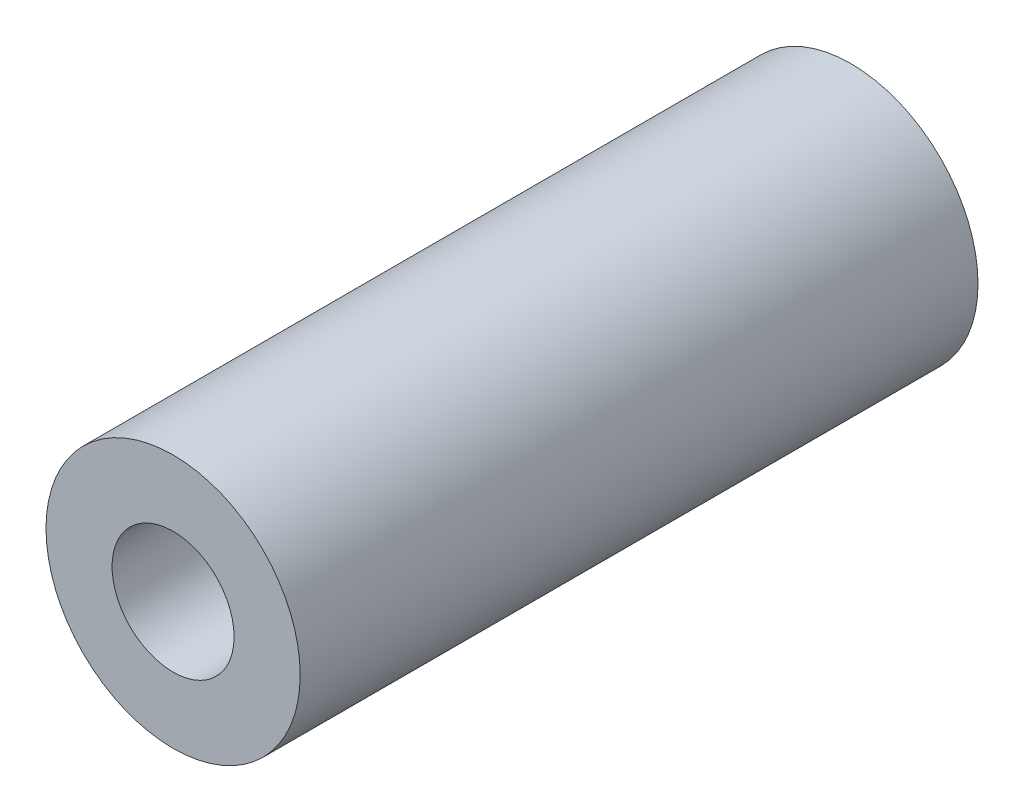
ISO-10303-21;
HEADER;
FILE_DESCRIPTION(('STEP AP214'),'2;1');
FILE_NAME('part.step','',(''),(''),'','','');
FILE_SCHEMA(('AUTOMOTIVE_DESIGN { 1 0 10303 214 1 1 1 1 }'));
ENDSEC;
DATA;
#1=APPLICATION_CONTEXT('core data for automotive mechanical design processes');
#2=APPLICATION_PROTOCOL_DEFINITION('international standard','automotive_design',2000,#1);
#3=PRODUCT_CONTEXT('',#1,'mechanical');
#4=PRODUCT('Part','Part','',(#3));
#5=PRODUCT_RELATED_PRODUCT_CATEGORY('part','',(#4));
#6=PRODUCT_DEFINITION_FORMATION('','',#4);
#7=PRODUCT_DEFINITION_CONTEXT('part definition',#1,'design');
#8=PRODUCT_DEFINITION('design','',#6,#7);
#9=PRODUCT_DEFINITION_SHAPE('','',#8);
#10=(LENGTH_UNIT() NAMED_UNIT(*) SI_UNIT(.MILLI.,.METRE.));
#11=(NAMED_UNIT(*) PLANE_ANGLE_UNIT() SI_UNIT($,.RADIAN.));
#12=(NAMED_UNIT(*) SI_UNIT($,.STERADIAN.) SOLID_ANGLE_UNIT());
#13=UNCERTAINTY_MEASURE_WITH_UNIT(LENGTH_MEASURE(1.E-05),#10,'distance_accuracy_value','');
#14=(GEOMETRIC_REPRESENTATION_CONTEXT(3) GLOBAL_UNCERTAINTY_ASSIGNED_CONTEXT((#13)) GLOBAL_UNIT_ASSIGNED_CONTEXT((#10,
#11,#12)) REPRESENTATION_CONTEXT('',''));
#15=CARTESIAN_POINT('',(0.,0.,0.));
#16=DIRECTION('',(0.,0.,1.));
#17=DIRECTION('',(1.,0.,0.));
#18=AXIS2_PLACEMENT_3D('',#15,#16,#17);
#19=CARTESIAN_POINT('',(0.,0.,6.35));
#20=DIRECTION('',(0.,0.,1.));
#21=DIRECTION('',(1.,0.,0.));
#22=AXIS2_PLACEMENT_3D('',#19,#20,#21);
#23=PLANE('',#22);
#24=CARTESIAN_POINT('',(0.,0.,6.35));
#25=DIRECTION('',(0.,0.,1.));
#26=DIRECTION('',(1.,0.,0.));
#27=AXIS2_PLACEMENT_3D('',#24,#25,#26);
#28=CIRCLE('',#27,2.38125);
#29=CARTESIAN_POINT('',(2.38125,0.,6.35));
#30=VERTEX_POINT('',#29);
#31=EDGE_CURVE('E10',#30,#30,#28,.T.);
#32=ORIENTED_EDGE('',*,*,#31,.T.);
#33=EDGE_LOOP('',(#32));
#34=FACE_BOUND('',#33,.T.);
#35=CARTESIAN_POINT('',(0.,0.,6.35));
#36=DIRECTION('',(0.,0.,1.));
#37=DIRECTION('',(1.,0.,0.));
#38=AXIS2_PLACEMENT_3D('',#35,#36,#37);
#39=CIRCLE('',#38,1.143);
#40=CARTESIAN_POINT('',(1.143,0.,6.35));
#41=VERTEX_POINT('',#40);
#42=EDGE_CURVE('E41',#41,#41,#39,.T.);
#43=ORIENTED_EDGE('',*,*,#42,.F.);
#44=EDGE_LOOP('',(#43));
#45=FACE_BOUND('',#44,.T.);
#46=ADVANCED_FACE('F30',(#34,#45),#23,.T.);
#47=CARTESIAN_POINT('',(0.,0.,-6.35));
#48=DIRECTION('',(0.,0.,1.));
#49=DIRECTION('',(1.,0.,0.));
#50=AXIS2_PLACEMENT_3D('',#47,#48,#49);
#51=PLANE('',#50);
#52=CARTESIAN_POINT('',(0.,0.,-6.35));
#53=DIRECTION('',(0.,0.,1.));
#54=DIRECTION('',(1.,0.,0.));
#55=AXIS2_PLACEMENT_3D('',#52,#53,#54);
#56=CIRCLE('',#55,2.38125);
#57=CARTESIAN_POINT('',(2.38125,0.,-6.35));
#58=VERTEX_POINT('',#57);
#59=EDGE_CURVE('E34',#58,#58,#56,.T.);
#60=ORIENTED_EDGE('',*,*,#59,.F.);
#61=EDGE_LOOP('',(#60));
#62=FACE_BOUND('',#61,.T.);
#63=CARTESIAN_POINT('',(0.,0.,-6.35));
#64=DIRECTION('',(0.,0.,1.));
#65=DIRECTION('',(1.,0.,0.));
#66=AXIS2_PLACEMENT_3D('',#63,#64,#65);
#67=CIRCLE('',#66,1.143);
#68=CARTESIAN_POINT('',(1.143,0.,-6.35));
#69=VERTEX_POINT('',#68);
#70=EDGE_CURVE('E43',#69,#69,#67,.T.);
#71=ORIENTED_EDGE('',*,*,#70,.T.);
#72=EDGE_LOOP('',(#71));
#73=FACE_BOUND('',#72,.T.);
#74=ADVANCED_FACE('F53',(#62,#73),#51,.F.);
#75=CARTESIAN_POINT('',(0.,0.,6.35));
#76=DIRECTION('',(0.,0.,-1.));
#77=DIRECTION('',(-1.,0.,0.));
#78=AXIS2_PLACEMENT_3D('',#75,#76,#77);
#79=CYLINDRICAL_SURFACE('',#78,2.38125);
#80=ORIENTED_EDGE('',*,*,#31,.F.);
#81=EDGE_LOOP('',(#80));
#82=FACE_BOUND('',#81,.T.);
#83=ORIENTED_EDGE('',*,*,#59,.T.);
#84=EDGE_LOOP('',(#83));
#85=FACE_BOUND('',#84,.T.);
#86=ADVANCED_FACE('F32',(#82,#85),#79,.T.);
#87=CARTESIAN_POINT('',(0.,0.,6.35));
#88=DIRECTION('',(0.,0.,-1.));
#89=DIRECTION('',(-1.,0.,0.));
#90=AXIS2_PLACEMENT_3D('',#87,#88,#89);
#91=CYLINDRICAL_SURFACE('',#90,1.143);
#92=ORIENTED_EDGE('',*,*,#42,.T.);
#93=EDGE_LOOP('',(#92));
#94=FACE_BOUND('',#93,.T.);
#95=ORIENTED_EDGE('',*,*,#70,.F.);
#96=EDGE_LOOP('',(#95));
#97=FACE_BOUND('',#96,.T.);
#98=ADVANCED_FACE('F49',(#94,#97),#91,.F.);
#99=CLOSED_SHELL('',(#46,#74,#86,#98));
#100=MANIFOLD_SOLID_BREP('B2',#99);
#101=ADVANCED_BREP_SHAPE_REPRESENTATION('',(#18,#100),#14);
#102=SHAPE_DEFINITION_REPRESENTATION(#9,#101);
ENDSEC;
END-ISO-10303-21;
